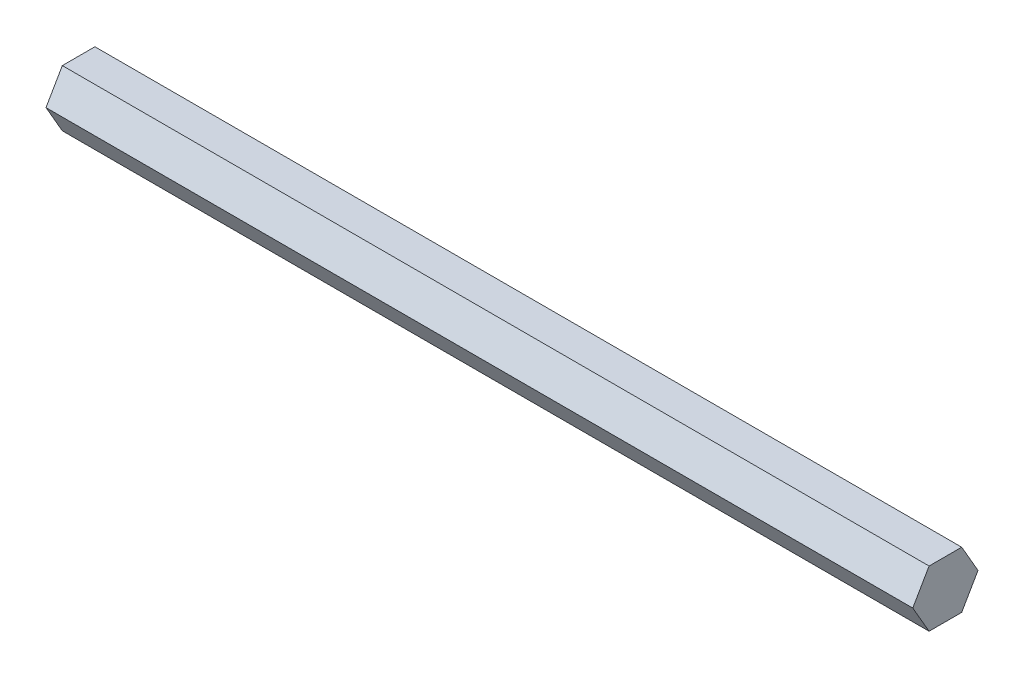
ISO-10303-21;
HEADER;
FILE_DESCRIPTION(('STEP AP214'),'2;1');
FILE_NAME('part.step','',(''),(''),'','','');
FILE_SCHEMA(('AUTOMOTIVE_DESIGN { 1 0 10303 214 1 1 1 1 }'));
ENDSEC;
DATA;
#1=APPLICATION_CONTEXT('core data for automotive mechanical design processes');
#2=APPLICATION_PROTOCOL_DEFINITION('international standard','automotive_design',2000,#1);
#3=PRODUCT_CONTEXT('',#1,'mechanical');
#4=PRODUCT('Part','Part','',(#3));
#5=PRODUCT_RELATED_PRODUCT_CATEGORY('part','',(#4));
#6=PRODUCT_DEFINITION_FORMATION('','',#4);
#7=PRODUCT_DEFINITION_CONTEXT('part definition',#1,'design');
#8=PRODUCT_DEFINITION('design','',#6,#7);
#9=PRODUCT_DEFINITION_SHAPE('','',#8);
#10=(LENGTH_UNIT() NAMED_UNIT(*) SI_UNIT(.MILLI.,.METRE.));
#11=(NAMED_UNIT(*) PLANE_ANGLE_UNIT() SI_UNIT($,.RADIAN.));
#12=(NAMED_UNIT(*) SI_UNIT($,.STERADIAN.) SOLID_ANGLE_UNIT());
#13=UNCERTAINTY_MEASURE_WITH_UNIT(LENGTH_MEASURE(1.E-05),#10,'distance_accuracy_value','');
#14=(GEOMETRIC_REPRESENTATION_CONTEXT(3) GLOBAL_UNCERTAINTY_ASSIGNED_CONTEXT((#13)) GLOBAL_UNIT_ASSIGNED_CONTEXT((#10,
#11,#12)) REPRESENTATION_CONTEXT('',''));
#15=CARTESIAN_POINT('',(0.,0.,0.));
#16=DIRECTION('',(0.,0.,1.));
#17=DIRECTION('',(1.,0.,0.));
#18=AXIS2_PLACEMENT_3D('',#15,#16,#17);
#19=CARTESIAN_POINT('',(194.85,-6.34999999999996,-3.6661742093542));
#20=DIRECTION('',(0.,0.499999999999995,0.866025403784441));
#21=DIRECTION('',(0.,-0.866025403784442,0.499999999999995));
#22=AXIS2_PLACEMENT_3D('',#19,#20,#21);
#23=PLANE('',#22);
#24=DIRECTION('',(0.,0.866025403784442,-0.499999999999995));
#25=VECTOR('',#24,1.);
#26=CARTESIAN_POINT('',(0.,-6.34999999999996,-3.6661742093542));
#27=LINE('',#26,#25);
#28=CARTESIAN_POINT('',(0.,-6.34999999999996,-3.6661742093542));
#29=VERTEX_POINT('',#28);
#30=CARTESIAN_POINT('',(0.,0.,-7.33234841870825));
#31=VERTEX_POINT('',#30);
#32=EDGE_CURVE('E123',#29,#31,#27,.T.);
#33=ORIENTED_EDGE('',*,*,#32,.T.);
#34=DIRECTION('',(-1.,0.,0.));
#35=VECTOR('',#34,1.);
#36=CARTESIAN_POINT('',(194.85,0.,-7.33234841870825));
#37=LINE('',#36,#35);
#38=CARTESIAN_POINT('',(194.85,0.,-7.33234841870825));
#39=VERTEX_POINT('',#38);
#40=EDGE_CURVE('E11',#39,#31,#37,.T.);
#41=ORIENTED_EDGE('',*,*,#40,.F.);
#42=DIRECTION('',(0.,0.866025403784442,-0.499999999999995));
#43=VECTOR('',#42,1.);
#44=CARTESIAN_POINT('',(194.85,-6.34999999999996,-3.6661742093542));
#45=LINE('',#44,#43);
#46=CARTESIAN_POINT('',(194.85,-6.34999999999996,-3.6661742093542));
#47=VERTEX_POINT('',#46);
#48=EDGE_CURVE('E133',#47,#39,#45,.T.);
#49=ORIENTED_EDGE('',*,*,#48,.F.);
#50=DIRECTION('',(-1.,0.,0.));
#51=VECTOR('',#50,1.);
#52=CARTESIAN_POINT('',(194.85,-6.34999999999996,-3.6661742093542));
#53=LINE('',#52,#51);
#54=EDGE_CURVE('E119',#47,#29,#53,.T.);
#55=ORIENTED_EDGE('',*,*,#54,.T.);
#56=EDGE_LOOP('',(#33,#41,#49,#55));
#57=FACE_BOUND('',#56,.T.);
#58=ADVANCED_FACE('F39',(#57),#23,.F.);
#59=CARTESIAN_POINT('',(194.85,0.,-7.33234841870825));
#60=DIRECTION('',(0.,-0.500000000000001,0.866025403784438));
#61=DIRECTION('',(0.,-0.866025403784438,-0.500000000000001));
#62=AXIS2_PLACEMENT_3D('',#59,#60,#61);
#63=PLANE('',#62);
#64=DIRECTION('',(0.,0.866025403784438,0.500000000000001));
#65=VECTOR('',#64,1.);
#66=CARTESIAN_POINT('',(0.,0.,-7.33234841870825));
#67=LINE('',#66,#65);
#68=CARTESIAN_POINT('',(0.,6.35000000000001,-3.66617420935411));
#69=VERTEX_POINT('',#68);
#70=EDGE_CURVE('E126',#31,#69,#67,.T.);
#71=ORIENTED_EDGE('',*,*,#70,.T.);
#72=DIRECTION('',(-1.,0.,0.));
#73=VECTOR('',#72,1.);
#74=CARTESIAN_POINT('',(194.85,6.35000000000001,-3.66617420935411));
#75=LINE('',#74,#73);
#76=CARTESIAN_POINT('',(194.85,6.35000000000001,-3.66617420935411));
#77=VERTEX_POINT('',#76);
#78=EDGE_CURVE('E47',#77,#69,#75,.T.);
#79=ORIENTED_EDGE('',*,*,#78,.F.);
#80=DIRECTION('',(0.,0.866025403784438,0.500000000000001));
#81=VECTOR('',#80,1.);
#82=CARTESIAN_POINT('',(194.85,0.,-7.33234841870825));
#83=LINE('',#82,#81);
#84=EDGE_CURVE('E92',#39,#77,#83,.T.);
#85=ORIENTED_EDGE('',*,*,#84,.F.);
#86=ORIENTED_EDGE('',*,*,#40,.T.);
#87=EDGE_LOOP('',(#71,#79,#85,#86));
#88=FACE_BOUND('',#87,.T.);
#89=ADVANCED_FACE('F157',(#88),#63,.F.);
#90=CARTESIAN_POINT('',(194.85,6.35000000000001,-3.66617420935411));
#91=DIRECTION('',(0.,-1.,0.));
#92=DIRECTION('',(0.,0.,-1.));
#93=AXIS2_PLACEMENT_3D('',#90,#91,#92);
#94=PLANE('',#93);
#95=DIRECTION('',(0.,0.,1.));
#96=VECTOR('',#95,1.);
#97=CARTESIAN_POINT('',(0.,6.35000000000001,-3.66617420935411));
#98=LINE('',#97,#96);
#99=CARTESIAN_POINT('',(0.,6.34999999999999,3.66617420935415));
#100=VERTEX_POINT('',#99);
#101=EDGE_CURVE('E128',#69,#100,#98,.T.);
#102=ORIENTED_EDGE('',*,*,#101,.T.);
#103=DIRECTION('',(-1.,0.,0.));
#104=VECTOR('',#103,1.);
#105=CARTESIAN_POINT('',(194.85,6.34999999999999,3.66617420935415));
#106=LINE('',#105,#104);
#107=CARTESIAN_POINT('',(194.85,6.34999999999999,3.66617420935415));
#108=VERTEX_POINT('',#107);
#109=EDGE_CURVE('E114',#108,#100,#106,.T.);
#110=ORIENTED_EDGE('',*,*,#109,.F.);
#111=DIRECTION('',(0.,0.,1.));
#112=VECTOR('',#111,1.);
#113=CARTESIAN_POINT('',(194.85,6.35000000000001,-3.66617420935411));
#114=LINE('',#113,#112);
#115=EDGE_CURVE('E105',#77,#108,#114,.T.);
#116=ORIENTED_EDGE('',*,*,#115,.F.);
#117=ORIENTED_EDGE('',*,*,#78,.T.);
#118=EDGE_LOOP('',(#102,#110,#116,#117));
#119=FACE_BOUND('',#118,.T.);
#120=ADVANCED_FACE('F139',(#119),#94,.F.);
#121=CARTESIAN_POINT('',(194.85,6.34999999999999,3.66617420935415));
#122=DIRECTION('',(0.,-0.499999999999995,-0.866025403784442));
#123=DIRECTION('',(0.,0.866025403784442,-0.499999999999995));
#124=AXIS2_PLACEMENT_3D('',#121,#122,#123);
#125=PLANE('',#124);
#126=DIRECTION('',(0.,-0.866025403784442,0.499999999999995));
#127=VECTOR('',#126,1.);
#128=CARTESIAN_POINT('',(0.,6.34999999999999,3.66617420935415));
#129=LINE('',#128,#127);
#130=CARTESIAN_POINT('',(0.,0.,7.33234841870825));
#131=VERTEX_POINT('',#130);
#132=EDGE_CURVE('E113',#100,#131,#129,.T.);
#133=ORIENTED_EDGE('',*,*,#132,.T.);
#134=DIRECTION('',(-1.,0.,0.));
#135=VECTOR('',#134,1.);
#136=CARTESIAN_POINT('',(194.85,0.,7.33234841870825));
#137=LINE('',#136,#135);
#138=CARTESIAN_POINT('',(194.85,0.,7.33234841870825));
#139=VERTEX_POINT('',#138);
#140=EDGE_CURVE('E110',#139,#131,#137,.T.);
#141=ORIENTED_EDGE('',*,*,#140,.F.);
#142=DIRECTION('',(0.,-0.866025403784442,0.499999999999995));
#143=VECTOR('',#142,1.);
#144=CARTESIAN_POINT('',(194.85,6.34999999999999,3.66617420935415));
#145=LINE('',#144,#143);
#146=EDGE_CURVE('E99',#108,#139,#145,.T.);
#147=ORIENTED_EDGE('',*,*,#146,.F.);
#148=ORIENTED_EDGE('',*,*,#109,.T.);
#149=EDGE_LOOP('',(#133,#141,#147,#148));
#150=FACE_BOUND('',#149,.T.);
#151=ADVANCED_FACE('F111',(#150),#125,.F.);
#152=CARTESIAN_POINT('',(194.85,0.,7.33234841870825));
#153=DIRECTION('',(0.,0.500000000000007,-0.866025403784435));
#154=DIRECTION('',(0.,0.866025403784435,0.500000000000007));
#155=AXIS2_PLACEMENT_3D('',#152,#153,#154);
#156=PLANE('',#155);
#157=DIRECTION('',(0.,-0.866025403784434,-0.500000000000007));
#158=VECTOR('',#157,1.);
#159=CARTESIAN_POINT('',(0.,0.,7.33234841870825));
#160=LINE('',#159,#158);
#161=CARTESIAN_POINT('',(0.,-6.35000000000004,3.66617420935407));
#162=VERTEX_POINT('',#161);
#163=EDGE_CURVE('E78',#131,#162,#160,.T.);
#164=ORIENTED_EDGE('',*,*,#163,.T.);
#165=DIRECTION('',(-1.,0.,0.));
#166=VECTOR('',#165,1.);
#167=CARTESIAN_POINT('',(194.85,-6.35000000000004,3.66617420935407));
#168=LINE('',#167,#166);
#169=CARTESIAN_POINT('',(194.85,-6.35000000000004,3.66617420935407));
#170=VERTEX_POINT('',#169);
#171=EDGE_CURVE('E115',#170,#162,#168,.T.);
#172=ORIENTED_EDGE('',*,*,#171,.F.);
#173=DIRECTION('',(0.,-0.866025403784434,-0.500000000000007));
#174=VECTOR('',#173,1.);
#175=CARTESIAN_POINT('',(194.85,0.,7.33234841870825));
#176=LINE('',#175,#174);
#177=EDGE_CURVE('E103',#139,#170,#176,.T.);
#178=ORIENTED_EDGE('',*,*,#177,.F.);
#179=ORIENTED_EDGE('',*,*,#140,.T.);
#180=EDGE_LOOP('',(#164,#172,#178,#179));
#181=FACE_BOUND('',#180,.T.);
#182=ADVANCED_FACE('F117',(#181),#156,.F.);
#183=CARTESIAN_POINT('',(194.85,-6.35000000000004,3.66617420935407));
#184=DIRECTION('',(0.,1.,0.));
#185=DIRECTION('',(0.,0.,1.));
#186=AXIS2_PLACEMENT_3D('',#183,#184,#185);
#187=PLANE('',#186);
#188=DIRECTION('',(0.,0.,-1.));
#189=VECTOR('',#188,1.);
#190=CARTESIAN_POINT('',(0.,-6.35000000000004,3.66617420935407));
#191=LINE('',#190,#189);
#192=EDGE_CURVE('E84',#162,#29,#191,.T.);
#193=ORIENTED_EDGE('',*,*,#192,.T.);
#194=ORIENTED_EDGE('',*,*,#54,.F.);
#195=DIRECTION('',(0.,0.,-1.));
#196=VECTOR('',#195,1.);
#197=CARTESIAN_POINT('',(194.85,-6.35000000000004,3.66617420935407));
#198=LINE('',#197,#196);
#199=EDGE_CURVE('E55',#170,#47,#198,.T.);
#200=ORIENTED_EDGE('',*,*,#199,.F.);
#201=ORIENTED_EDGE('',*,*,#171,.T.);
#202=EDGE_LOOP('',(#193,#194,#200,#201));
#203=FACE_BOUND('',#202,.T.);
#204=ADVANCED_FACE('F146',(#203),#187,.F.);
#205=CARTESIAN_POINT('',(194.85,0.,0.));
#206=DIRECTION('',(1.,0.,0.));
#207=DIRECTION('',(0.,0.,-1.));
#208=AXIS2_PLACEMENT_3D('',#205,#206,#207);
#209=PLANE('',#208);
#210=ORIENTED_EDGE('',*,*,#48,.T.);
#211=ORIENTED_EDGE('',*,*,#84,.T.);
#212=ORIENTED_EDGE('',*,*,#115,.T.);
#213=ORIENTED_EDGE('',*,*,#146,.T.);
#214=ORIENTED_EDGE('',*,*,#177,.T.);
#215=ORIENTED_EDGE('',*,*,#199,.T.);
#216=EDGE_LOOP('',(#210,#211,#212,#213,#214,#215));
#217=FACE_BOUND('',#216,.T.);
#218=ADVANCED_FACE('F101',(#217),#209,.T.);
#219=CARTESIAN_POINT('',(0.,0.,0.));
#220=DIRECTION('',(1.,0.,0.));
#221=DIRECTION('',(0.,0.,-1.));
#222=AXIS2_PLACEMENT_3D('',#219,#220,#221);
#223=PLANE('',#222);
#224=ORIENTED_EDGE('',*,*,#32,.F.);
#225=ORIENTED_EDGE('',*,*,#192,.F.);
#226=ORIENTED_EDGE('',*,*,#163,.F.);
#227=ORIENTED_EDGE('',*,*,#132,.F.);
#228=ORIENTED_EDGE('',*,*,#101,.F.);
#229=ORIENTED_EDGE('',*,*,#70,.F.);
#230=EDGE_LOOP('',(#224,#225,#226,#227,#228,#229));
#231=FACE_BOUND('',#230,.T.);
#232=ADVANCED_FACE('F142',(#231),#223,.F.);
#233=CLOSED_SHELL('',(#58,#89,#120,#151,#182,#204,#218,#232));
#234=MANIFOLD_SOLID_BREP('B2',#233);
#235=ADVANCED_BREP_SHAPE_REPRESENTATION('',(#18,#234),#14);
#236=SHAPE_DEFINITION_REPRESENTATION(#9,#235);
ENDSEC;
END-ISO-10303-21;
